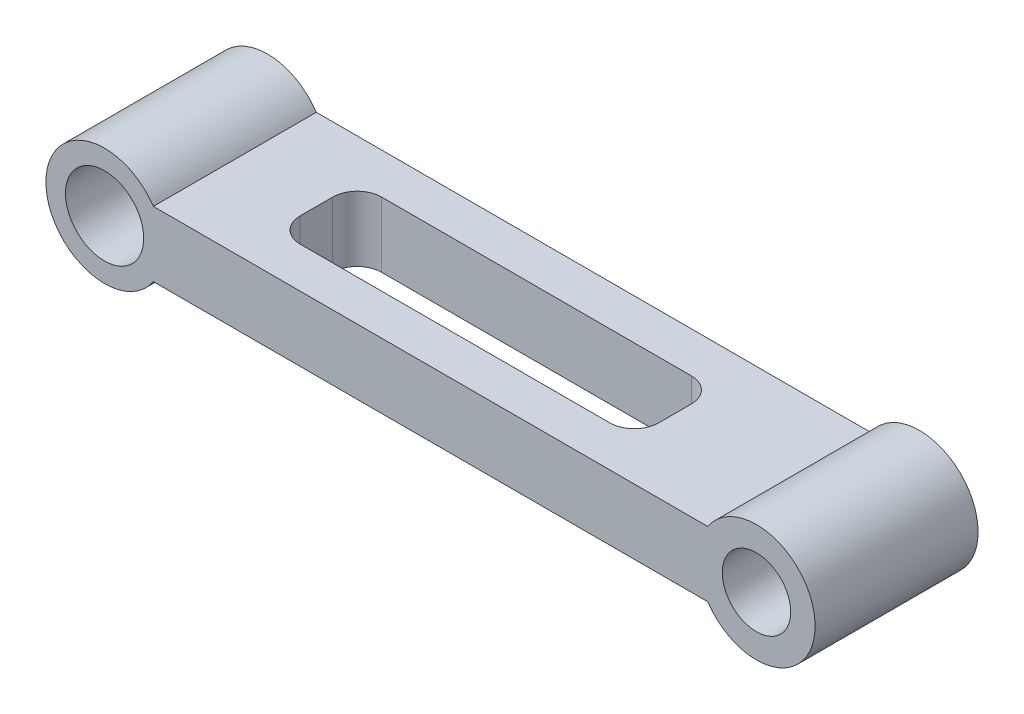
ISO-10303-21;
HEADER;
FILE_DESCRIPTION(('STEP AP214'),'2;1');
FILE_NAME('part.step','',(''),(''),'','','');
FILE_SCHEMA(('AUTOMOTIVE_DESIGN { 1 0 10303 214 1 1 1 1 }'));
ENDSEC;
DATA;
#1=APPLICATION_CONTEXT('core data for automotive mechanical design processes');
#2=APPLICATION_PROTOCOL_DEFINITION('international standard','automotive_design',2000,#1);
#3=PRODUCT_CONTEXT('',#1,'mechanical');
#4=PRODUCT('Part','Part','',(#3));
#5=PRODUCT_RELATED_PRODUCT_CATEGORY('part','',(#4));
#6=PRODUCT_DEFINITION_FORMATION('','',#4);
#7=PRODUCT_DEFINITION_CONTEXT('part definition',#1,'design');
#8=PRODUCT_DEFINITION('design','',#6,#7);
#9=PRODUCT_DEFINITION_SHAPE('','',#8);
#10=(LENGTH_UNIT() NAMED_UNIT(*) SI_UNIT(.MILLI.,.METRE.));
#11=(NAMED_UNIT(*) PLANE_ANGLE_UNIT() SI_UNIT($,.RADIAN.));
#12=(NAMED_UNIT(*) SI_UNIT($,.STERADIAN.) SOLID_ANGLE_UNIT());
#13=UNCERTAINTY_MEASURE_WITH_UNIT(LENGTH_MEASURE(1.E-05),#10,'distance_accuracy_value','');
#14=(GEOMETRIC_REPRESENTATION_CONTEXT(3) GLOBAL_UNCERTAINTY_ASSIGNED_CONTEXT((#13)) GLOBAL_UNIT_ASSIGNED_CONTEXT((#10,
#11,#12)) REPRESENTATION_CONTEXT('',''));
#15=CARTESIAN_POINT('',(0.,0.,0.));
#16=DIRECTION('',(0.,0.,1.));
#17=DIRECTION('',(1.,0.,0.));
#18=AXIS2_PLACEMENT_3D('',#15,#16,#17);
#19=CARTESIAN_POINT('',(400.,0.,50.));
#20=DIRECTION('',(0.,0.,1.));
#21=DIRECTION('',(1.,0.,0.));
#22=AXIS2_PLACEMENT_3D('',#19,#20,#21);
#23=PLANE('',#22);
#24=CARTESIAN_POINT('',(0.,0.,50.));
#25=DIRECTION('',(0.,0.,1.));
#26=DIRECTION('',(1.,0.,0.));
#27=AXIS2_PLACEMENT_3D('',#24,#25,#26);
#28=CIRCLE('',#27,24.);
#29=CARTESIAN_POINT('',(24.,0.,50.));
#30=VERTEX_POINT('',#29);
#31=EDGE_CURVE('E202',#30,#30,#28,.T.);
#32=ORIENTED_EDGE('',*,*,#31,.F.);
#33=EDGE_LOOP('',(#32));
#34=FACE_BOUND('',#33,.T.);
#35=CARTESIAN_POINT('',(400.,0.,50.));
#36=DIRECTION('',(0.,0.,1.));
#37=DIRECTION('',(1.,0.,0.));
#38=AXIS2_PLACEMENT_3D('',#35,#36,#37);
#39=CIRCLE('',#38,36.);
#40=CARTESIAN_POINT('',(370.066740905809,-20.,50.));
#41=VERTEX_POINT('',#40);
#42=CARTESIAN_POINT('',(370.066740905809,20.,50.));
#43=VERTEX_POINT('',#42);
#44=EDGE_CURVE('E210',#41,#43,#39,.T.);
#45=ORIENTED_EDGE('',*,*,#44,.T.);
#46=DIRECTION('',(-1.,0.,0.));
#47=VECTOR('',#46,1.);
#48=CARTESIAN_POINT('',(29.9332590941915,20.,50.));
#49=LINE('',#48,#47);
#50=CARTESIAN_POINT('',(29.9332590941915,20.,50.));
#51=VERTEX_POINT('',#50);
#52=EDGE_CURVE('E214',#43,#51,#49,.T.);
#53=ORIENTED_EDGE('',*,*,#52,.T.);
#54=CARTESIAN_POINT('',(0.,0.,50.));
#55=DIRECTION('',(0.,0.,1.));
#56=DIRECTION('',(1.,0.,0.));
#57=AXIS2_PLACEMENT_3D('',#54,#55,#56);
#58=CIRCLE('',#57,36.);
#59=CARTESIAN_POINT('',(29.9332590941915,-20.,50.));
#60=VERTEX_POINT('',#59);
#61=EDGE_CURVE('E218',#51,#60,#58,.T.);
#62=ORIENTED_EDGE('',*,*,#61,.T.);
#63=DIRECTION('',(1.,0.,0.));
#64=VECTOR('',#63,1.);
#65=CARTESIAN_POINT('',(29.9332590941915,-20.,50.));
#66=LINE('',#65,#64);
#67=EDGE_CURVE('E221',#60,#41,#66,.T.);
#68=ORIENTED_EDGE('',*,*,#67,.T.);
#69=EDGE_LOOP('',(#45,#53,#62,#68));
#70=FACE_BOUND('',#69,.T.);
#71=CARTESIAN_POINT('',(400.,0.,50.));
#72=DIRECTION('',(0.,0.,1.));
#73=DIRECTION('',(1.,0.,0.));
#74=AXIS2_PLACEMENT_3D('',#71,#72,#73);
#75=CIRCLE('',#74,21.);
#76=CARTESIAN_POINT('',(421.,0.,50.));
#77=VERTEX_POINT('',#76);
#78=EDGE_CURVE('E194',#77,#77,#75,.T.);
#79=ORIENTED_EDGE('',*,*,#78,.F.);
#80=EDGE_LOOP('',(#79));
#81=FACE_BOUND('',#80,.T.);
#82=ADVANCED_FACE('F39',(#34,#70,#81),#23,.T.);
#83=CARTESIAN_POINT('',(400.,0.,-50.));
#84=DIRECTION('',(0.,0.,1.));
#85=DIRECTION('',(1.,0.,0.));
#86=AXIS2_PLACEMENT_3D('',#83,#84,#85);
#87=PLANE('',#86);
#88=CARTESIAN_POINT('',(400.,0.,-50.));
#89=DIRECTION('',(0.,0.,1.));
#90=DIRECTION('',(1.,0.,0.));
#91=AXIS2_PLACEMENT_3D('',#88,#89,#90);
#92=CIRCLE('',#91,36.);
#93=CARTESIAN_POINT('',(370.066740905809,-20.,-50.));
#94=VERTEX_POINT('',#93);
#95=CARTESIAN_POINT('',(370.066740905809,20.,-50.));
#96=VERTEX_POINT('',#95);
#97=EDGE_CURVE('E206',#94,#96,#92,.T.);
#98=ORIENTED_EDGE('',*,*,#97,.F.);
#99=DIRECTION('',(1.,0.,0.));
#100=VECTOR('',#99,1.);
#101=CARTESIAN_POINT('',(29.9332590941915,-20.,-50.));
#102=LINE('',#101,#100);
#103=CARTESIAN_POINT('',(29.9332590941915,-20.,-50.));
#104=VERTEX_POINT('',#103);
#105=EDGE_CURVE('E215',#104,#94,#102,.T.);
#106=ORIENTED_EDGE('',*,*,#105,.F.);
#107=CARTESIAN_POINT('',(0.,0.,-50.));
#108=DIRECTION('',(0.,0.,1.));
#109=DIRECTION('',(1.,0.,0.));
#110=AXIS2_PLACEMENT_3D('',#107,#108,#109);
#111=CIRCLE('',#110,36.);
#112=CARTESIAN_POINT('',(29.9332590941915,20.,-50.));
#113=VERTEX_POINT('',#112);
#114=EDGE_CURVE('E231',#113,#104,#111,.T.);
#115=ORIENTED_EDGE('',*,*,#114,.F.);
#116=DIRECTION('',(-1.,0.,0.));
#117=VECTOR('',#116,1.);
#118=CARTESIAN_POINT('',(29.9332590941915,20.,-50.));
#119=LINE('',#118,#117);
#120=EDGE_CURVE('E228',#96,#113,#119,.T.);
#121=ORIENTED_EDGE('',*,*,#120,.F.);
#122=EDGE_LOOP('',(#98,#106,#115,#121));
#123=FACE_BOUND('',#122,.T.);
#124=CARTESIAN_POINT('',(0.,0.,-50.));
#125=DIRECTION('',(0.,0.,1.));
#126=DIRECTION('',(1.,0.,0.));
#127=AXIS2_PLACEMENT_3D('',#124,#125,#126);
#128=CIRCLE('',#127,24.);
#129=CARTESIAN_POINT('',(24.,0.,-50.));
#130=VERTEX_POINT('',#129);
#131=EDGE_CURVE('E198',#130,#130,#128,.T.);
#132=ORIENTED_EDGE('',*,*,#131,.T.);
#133=EDGE_LOOP('',(#132));
#134=FACE_BOUND('',#133,.T.);
#135=CARTESIAN_POINT('',(400.,0.,-50.));
#136=DIRECTION('',(0.,0.,1.));
#137=DIRECTION('',(1.,0.,0.));
#138=AXIS2_PLACEMENT_3D('',#135,#136,#137);
#139=CIRCLE('',#138,21.);
#140=CARTESIAN_POINT('',(421.,0.,-50.));
#141=VERTEX_POINT('',#140);
#142=EDGE_CURVE('E177',#141,#141,#139,.T.);
#143=ORIENTED_EDGE('',*,*,#142,.T.);
#144=EDGE_LOOP('',(#143));
#145=FACE_BOUND('',#144,.T.);
#146=ADVANCED_FACE('F309',(#123,#134,#145),#87,.F.);
#147=CARTESIAN_POINT('',(400.,0.,50.));
#148=DIRECTION('',(0.,0.,-1.));
#149=DIRECTION('',(-1.,0.,0.));
#150=AXIS2_PLACEMENT_3D('',#147,#148,#149);
#151=CYLINDRICAL_SURFACE('',#150,36.);
#152=ORIENTED_EDGE('',*,*,#97,.T.);
#153=DIRECTION('',(0.,0.,-1.));
#154=VECTOR('',#153,1.);
#155=CARTESIAN_POINT('',(370.066740905809,20.,50.));
#156=LINE('',#155,#154);
#157=EDGE_CURVE('E247',#43,#96,#156,.T.);
#158=ORIENTED_EDGE('',*,*,#157,.F.);
#159=ORIENTED_EDGE('',*,*,#44,.F.);
#160=DIRECTION('',(0.,0.,-1.));
#161=VECTOR('',#160,1.);
#162=CARTESIAN_POINT('',(370.066740905809,-20.,50.));
#163=LINE('',#162,#161);
#164=EDGE_CURVE('E224',#41,#94,#163,.T.);
#165=ORIENTED_EDGE('',*,*,#164,.T.);
#166=EDGE_LOOP('',(#152,#158,#159,#165));
#167=FACE_BOUND('',#166,.T.);
#168=ADVANCED_FACE('F41',(#167),#151,.T.);
#169=CARTESIAN_POINT('',(29.9332590941915,20.,50.));
#170=DIRECTION('',(0.,-1.,0.));
#171=DIRECTION('',(0.,0.,-1.));
#172=AXIS2_PLACEMENT_3D('',#169,#170,#171);
#173=PLANE('',#172);
#174=DIRECTION('',(-1.,0.,0.));
#175=VECTOR('',#174,1.);
#176=CARTESIAN_POINT('',(95.0000000000001,20.,-25.));
#177=LINE('',#176,#175);
#178=CARTESIAN_POINT('',(285.,20.,-25.));
#179=VERTEX_POINT('',#178);
#180=CARTESIAN_POINT('',(95.0000000000001,20.,-25.));
#181=VERTEX_POINT('',#180);
#182=EDGE_CURVE('E142',#179,#181,#177,.T.);
#183=ORIENTED_EDGE('',*,*,#182,.F.);
#184=CARTESIAN_POINT('',(285.,20.,-10.));
#185=DIRECTION('',(0.,1.,0.));
#186=DIRECTION('',(1.,0.,0.));
#187=AXIS2_PLACEMENT_3D('',#184,#185,#186);
#188=CIRCLE('',#187,15.);
#189=CARTESIAN_POINT('',(300.,20.,-9.9999999999999));
#190=VERTEX_POINT('',#189);
#191=EDGE_CURVE('E55',#190,#179,#188,.T.);
#192=ORIENTED_EDGE('',*,*,#191,.F.);
#193=DIRECTION('',(0.,0.,-1.));
#194=VECTOR('',#193,1.);
#195=CARTESIAN_POINT('',(300.,20.,-9.9999999999999));
#196=LINE('',#195,#194);
#197=CARTESIAN_POINT('',(300.,20.,9.9999999999999));
#198=VERTEX_POINT('',#197);
#199=EDGE_CURVE('E170',#198,#190,#196,.T.);
#200=ORIENTED_EDGE('',*,*,#199,.F.);
#201=CARTESIAN_POINT('',(285.,20.,10.));
#202=DIRECTION('',(0.,1.,0.));
#203=DIRECTION('',(-1.,0.,0.));
#204=AXIS2_PLACEMENT_3D('',#201,#202,#203);
#205=CIRCLE('',#204,15.);
#206=CARTESIAN_POINT('',(285.,20.,25.));
#207=VERTEX_POINT('',#206);
#208=EDGE_CURVE('E166',#207,#198,#205,.T.);
#209=ORIENTED_EDGE('',*,*,#208,.F.);
#210=DIRECTION('',(1.,0.,0.));
#211=VECTOR('',#210,1.);
#212=CARTESIAN_POINT('',(95.0000000000001,20.,25.));
#213=LINE('',#212,#211);
#214=CARTESIAN_POINT('',(95.0000000000001,20.,25.));
#215=VERTEX_POINT('',#214);
#216=EDGE_CURVE('E162',#215,#207,#213,.T.);
#217=ORIENTED_EDGE('',*,*,#216,.F.);
#218=CARTESIAN_POINT('',(95.,20.,10.));
#219=DIRECTION('',(0.,1.,0.));
#220=DIRECTION('',(-1.,0.,0.));
#221=AXIS2_PLACEMENT_3D('',#218,#219,#220);
#222=CIRCLE('',#221,15.);
#223=CARTESIAN_POINT('',(80.,20.,9.9999999999999));
#224=VERTEX_POINT('',#223);
#225=EDGE_CURVE('E155',#224,#215,#222,.T.);
#226=ORIENTED_EDGE('',*,*,#225,.F.);
#227=DIRECTION('',(0.,0.,1.));
#228=VECTOR('',#227,1.);
#229=CARTESIAN_POINT('',(80.,20.,-9.9999999999999));
#230=LINE('',#229,#228);
#231=CARTESIAN_POINT('',(80.,20.,-10.));
#232=VERTEX_POINT('',#231);
#233=EDGE_CURVE('E151',#232,#224,#230,.T.);
#234=ORIENTED_EDGE('',*,*,#233,.F.);
#235=CARTESIAN_POINT('',(95.,20.,-10.));
#236=DIRECTION('',(0.,1.,0.));
#237=DIRECTION('',(-1.,0.,0.));
#238=AXIS2_PLACEMENT_3D('',#235,#236,#237);
#239=CIRCLE('',#238,15.);
#240=EDGE_CURVE('E132',#181,#232,#239,.T.);
#241=ORIENTED_EDGE('',*,*,#240,.F.);
#242=EDGE_LOOP('',(#183,#192,#200,#209,#217,#226,#234,#241));
#243=FACE_BOUND('',#242,.T.);
#244=ORIENTED_EDGE('',*,*,#120,.T.);
#245=DIRECTION('',(0.,0.,-1.));
#246=VECTOR('',#245,1.);
#247=CARTESIAN_POINT('',(29.9332590941915,20.,50.));
#248=LINE('',#247,#246);
#249=EDGE_CURVE('E243',#51,#113,#248,.T.);
#250=ORIENTED_EDGE('',*,*,#249,.F.);
#251=ORIENTED_EDGE('',*,*,#52,.F.);
#252=ORIENTED_EDGE('',*,*,#157,.T.);
#253=EDGE_LOOP('',(#244,#250,#251,#252));
#254=FACE_BOUND('',#253,.T.);
#255=ADVANCED_FACE('F147',(#243,#254),#173,.F.);
#256=CARTESIAN_POINT('',(0.,0.,50.));
#257=DIRECTION('',(0.,0.,-1.));
#258=DIRECTION('',(-1.,0.,0.));
#259=AXIS2_PLACEMENT_3D('',#256,#257,#258);
#260=CYLINDRICAL_SURFACE('',#259,36.);
#261=ORIENTED_EDGE('',*,*,#114,.T.);
#262=DIRECTION('',(0.,0.,-1.));
#263=VECTOR('',#262,1.);
#264=CARTESIAN_POINT('',(29.9332590941915,-20.,50.));
#265=LINE('',#264,#263);
#266=EDGE_CURVE('E239',#60,#104,#265,.T.);
#267=ORIENTED_EDGE('',*,*,#266,.F.);
#268=ORIENTED_EDGE('',*,*,#61,.F.);
#269=ORIENTED_EDGE('',*,*,#249,.T.);
#270=EDGE_LOOP('',(#261,#267,#268,#269));
#271=FACE_BOUND('',#270,.T.);
#272=ADVANCED_FACE('F323',(#271),#260,.T.);
#273=CARTESIAN_POINT('',(29.9332590941915,-20.,50.));
#274=DIRECTION('',(0.,1.,0.));
#275=DIRECTION('',(0.,0.,1.));
#276=AXIS2_PLACEMENT_3D('',#273,#274,#275);
#277=PLANE('',#276);
#278=DIRECTION('',(0.,0.,-1.));
#279=VECTOR('',#278,1.);
#280=CARTESIAN_POINT('',(300.,-20.,50.));
#281=LINE('',#280,#279);
#282=CARTESIAN_POINT('',(300.,-20.,9.9999999999999));
#283=VERTEX_POINT('',#282);
#284=CARTESIAN_POINT('',(300.,-20.,-9.9999999999999));
#285=VERTEX_POINT('',#284);
#286=EDGE_CURVE('E48',#283,#285,#281,.T.);
#287=ORIENTED_EDGE('',*,*,#286,.T.);
#288=CARTESIAN_POINT('',(285.,-20.,-10.));
#289=DIRECTION('',(0.,1.,0.));
#290=DIRECTION('',(0.,0.,1.));
#291=AXIS2_PLACEMENT_3D('',#288,#289,#290);
#292=CIRCLE('',#291,15.);
#293=CARTESIAN_POINT('',(285.,-20.,-25.));
#294=VERTEX_POINT('',#293);
#295=EDGE_CURVE('E11',#285,#294,#292,.T.);
#296=ORIENTED_EDGE('',*,*,#295,.T.);
#297=DIRECTION('',(-1.,0.,0.));
#298=VECTOR('',#297,1.);
#299=CARTESIAN_POINT('',(29.9332590941915,-20.,-25.));
#300=LINE('',#299,#298);
#301=CARTESIAN_POINT('',(95.0000000000001,-20.,-25.));
#302=VERTEX_POINT('',#301);
#303=EDGE_CURVE('E251',#294,#302,#300,.T.);
#304=ORIENTED_EDGE('',*,*,#303,.T.);
#305=CARTESIAN_POINT('',(95.,-20.,-10.));
#306=DIRECTION('',(0.,1.,0.));
#307=DIRECTION('',(0.,0.,1.));
#308=AXIS2_PLACEMENT_3D('',#305,#306,#307);
#309=CIRCLE('',#308,15.);
#310=CARTESIAN_POINT('',(80.,-20.,-10.));
#311=VERTEX_POINT('',#310);
#312=EDGE_CURVE('E135',#302,#311,#309,.T.);
#313=ORIENTED_EDGE('',*,*,#312,.T.);
#314=DIRECTION('',(0.,0.,1.));
#315=VECTOR('',#314,1.);
#316=CARTESIAN_POINT('',(80.,-20.,50.));
#317=LINE('',#316,#315);
#318=CARTESIAN_POINT('',(80.,-20.,9.9999999999999));
#319=VERTEX_POINT('',#318);
#320=EDGE_CURVE('E256',#311,#319,#317,.T.);
#321=ORIENTED_EDGE('',*,*,#320,.T.);
#322=CARTESIAN_POINT('',(95.,-20.,10.));
#323=DIRECTION('',(0.,1.,0.));
#324=DIRECTION('',(0.,0.,1.));
#325=AXIS2_PLACEMENT_3D('',#322,#323,#324);
#326=CIRCLE('',#325,15.);
#327=CARTESIAN_POINT('',(95.0000000000001,-20.,25.));
#328=VERTEX_POINT('',#327);
#329=EDGE_CURVE('E260',#319,#328,#326,.T.);
#330=ORIENTED_EDGE('',*,*,#329,.T.);
#331=DIRECTION('',(1.,0.,0.));
#332=VECTOR('',#331,1.);
#333=CARTESIAN_POINT('',(29.9332590941915,-20.,25.));
#334=LINE('',#333,#332);
#335=CARTESIAN_POINT('',(285.,-20.,25.));
#336=VERTEX_POINT('',#335);
#337=EDGE_CURVE('E264',#328,#336,#334,.T.);
#338=ORIENTED_EDGE('',*,*,#337,.T.);
#339=CARTESIAN_POINT('',(285.,-20.,10.));
#340=DIRECTION('',(0.,1.,0.));
#341=DIRECTION('',(0.,0.,1.));
#342=AXIS2_PLACEMENT_3D('',#339,#340,#341);
#343=CIRCLE('',#342,15.);
#344=EDGE_CURVE('E268',#336,#283,#343,.T.);
#345=ORIENTED_EDGE('',*,*,#344,.T.);
#346=EDGE_LOOP('',(#287,#296,#304,#313,#321,#330,#338,#345));
#347=FACE_BOUND('',#346,.T.);
#348=ORIENTED_EDGE('',*,*,#105,.T.);
#349=ORIENTED_EDGE('',*,*,#164,.F.);
#350=ORIENTED_EDGE('',*,*,#67,.F.);
#351=ORIENTED_EDGE('',*,*,#266,.T.);
#352=EDGE_LOOP('',(#348,#349,#350,#351));
#353=FACE_BOUND('',#352,.T.);
#354=ADVANCED_FACE('F274',(#347,#353),#277,.F.);
#355=CARTESIAN_POINT('',(0.,0.,50.));
#356=DIRECTION('',(0.,0.,-1.));
#357=DIRECTION('',(-1.,0.,0.));
#358=AXIS2_PLACEMENT_3D('',#355,#356,#357);
#359=CYLINDRICAL_SURFACE('',#358,24.);
#360=ORIENTED_EDGE('',*,*,#31,.T.);
#361=EDGE_LOOP('',(#360));
#362=FACE_BOUND('',#361,.T.);
#363=ORIENTED_EDGE('',*,*,#131,.F.);
#364=EDGE_LOOP('',(#363));
#365=FACE_BOUND('',#364,.T.);
#366=ADVANCED_FACE('F304',(#362,#365),#359,.F.);
#367=CARTESIAN_POINT('',(400.,0.,50.));
#368=DIRECTION('',(0.,0.,-1.));
#369=DIRECTION('',(-1.,0.,0.));
#370=AXIS2_PLACEMENT_3D('',#367,#368,#369);
#371=CYLINDRICAL_SURFACE('',#370,21.);
#372=ORIENTED_EDGE('',*,*,#78,.T.);
#373=EDGE_LOOP('',(#372));
#374=FACE_BOUND('',#373,.T.);
#375=ORIENTED_EDGE('',*,*,#142,.F.);
#376=EDGE_LOOP('',(#375));
#377=FACE_BOUND('',#376,.T.);
#378=ADVANCED_FACE('F297',(#374,#377),#371,.F.);
#379=CARTESIAN_POINT('',(285.,-36.,-10.));
#380=DIRECTION('',(0.,1.,0.));
#381=DIRECTION('',(-1.,0.,0.));
#382=AXIS2_PLACEMENT_3D('',#379,#380,#381);
#383=CYLINDRICAL_SURFACE('',#382,15.);
#384=DIRECTION('',(0.,1.,0.));
#385=VECTOR('',#384,1.);
#386=CARTESIAN_POINT('',(300.,-36.,-9.9999999999999));
#387=LINE('',#386,#385);
#388=EDGE_CURVE('E174',#285,#190,#387,.T.);
#389=ORIENTED_EDGE('',*,*,#388,.T.);
#390=ORIENTED_EDGE('',*,*,#191,.T.);
#391=DIRECTION('',(0.,1.,0.));
#392=VECTOR('',#391,1.);
#393=CARTESIAN_POINT('',(285.,-36.,-25.));
#394=LINE('',#393,#392);
#395=EDGE_CURVE('E139',#294,#179,#394,.T.);
#396=ORIENTED_EDGE('',*,*,#395,.F.);
#397=ORIENTED_EDGE('',*,*,#295,.F.);
#398=EDGE_LOOP('',(#389,#390,#396,#397));
#399=FACE_BOUND('',#398,.T.);
#400=ADVANCED_FACE('F295',(#399),#383,.F.);
#401=CARTESIAN_POINT('',(300.,-36.,-9.9999999999999));
#402=DIRECTION('',(1.,0.,0.));
#403=DIRECTION('',(0.,1.,0.));
#404=AXIS2_PLACEMENT_3D('',#401,#402,#403);
#405=PLANE('',#404);
#406=DIRECTION('',(0.,1.,0.));
#407=VECTOR('',#406,1.);
#408=CARTESIAN_POINT('',(300.,-36.,9.9999999999999));
#409=LINE('',#408,#407);
#410=EDGE_CURVE('E178',#283,#198,#409,.T.);
#411=ORIENTED_EDGE('',*,*,#410,.T.);
#412=ORIENTED_EDGE('',*,*,#199,.T.);
#413=ORIENTED_EDGE('',*,*,#388,.F.);
#414=ORIENTED_EDGE('',*,*,#286,.F.);
#415=EDGE_LOOP('',(#411,#412,#413,#414));
#416=FACE_BOUND('',#415,.T.);
#417=ADVANCED_FACE('F279',(#416),#405,.F.);
#418=CARTESIAN_POINT('',(285.,-36.,10.));
#419=DIRECTION('',(0.,1.,0.));
#420=DIRECTION('',(-1.,0.,0.));
#421=AXIS2_PLACEMENT_3D('',#418,#419,#420);
#422=CYLINDRICAL_SURFACE('',#421,15.);
#423=DIRECTION('',(0.,1.,0.));
#424=VECTOR('',#423,1.);
#425=CARTESIAN_POINT('',(285.,-36.,25.));
#426=LINE('',#425,#424);
#427=EDGE_CURVE('E181',#336,#207,#426,.T.);
#428=ORIENTED_EDGE('',*,*,#427,.T.);
#429=ORIENTED_EDGE('',*,*,#208,.T.);
#430=ORIENTED_EDGE('',*,*,#410,.F.);
#431=ORIENTED_EDGE('',*,*,#344,.F.);
#432=EDGE_LOOP('',(#428,#429,#430,#431));
#433=FACE_BOUND('',#432,.T.);
#434=ADVANCED_FACE('F281',(#433),#422,.F.);
#435=CARTESIAN_POINT('',(95.0000000000001,-36.,25.));
#436=DIRECTION('',(0.,0.,1.));
#437=DIRECTION('',(1.,0.,0.));
#438=AXIS2_PLACEMENT_3D('',#435,#436,#437);
#439=PLANE('',#438);
#440=DIRECTION('',(0.,1.,0.));
#441=VECTOR('',#440,1.);
#442=CARTESIAN_POINT('',(95.0000000000001,-36.,25.));
#443=LINE('',#442,#441);
#444=EDGE_CURVE('E184',#328,#215,#443,.T.);
#445=ORIENTED_EDGE('',*,*,#444,.T.);
#446=ORIENTED_EDGE('',*,*,#216,.T.);
#447=ORIENTED_EDGE('',*,*,#427,.F.);
#448=ORIENTED_EDGE('',*,*,#337,.F.);
#449=EDGE_LOOP('',(#445,#446,#447,#448));
#450=FACE_BOUND('',#449,.T.);
#451=ADVANCED_FACE('F288',(#450),#439,.F.);
#452=CARTESIAN_POINT('',(95.,-36.,10.));
#453=DIRECTION('',(0.,1.,0.));
#454=DIRECTION('',(-1.,0.,0.));
#455=AXIS2_PLACEMENT_3D('',#452,#453,#454);
#456=CYLINDRICAL_SURFACE('',#455,15.);
#457=DIRECTION('',(0.,1.,0.));
#458=VECTOR('',#457,1.);
#459=CARTESIAN_POINT('',(80.,-36.,9.9999999999999));
#460=LINE('',#459,#458);
#461=EDGE_CURVE('E187',#319,#224,#460,.T.);
#462=ORIENTED_EDGE('',*,*,#461,.T.);
#463=ORIENTED_EDGE('',*,*,#225,.T.);
#464=ORIENTED_EDGE('',*,*,#444,.F.);
#465=ORIENTED_EDGE('',*,*,#329,.F.);
#466=EDGE_LOOP('',(#462,#463,#464,#465));
#467=FACE_BOUND('',#466,.T.);
#468=ADVANCED_FACE('F291',(#467),#456,.F.);
#469=CARTESIAN_POINT('',(80.,-36.,-9.9999999999999));
#470=DIRECTION('',(-1.,0.,0.));
#471=DIRECTION('',(0.,-1.,0.));
#472=AXIS2_PLACEMENT_3D('',#469,#470,#471);
#473=PLANE('',#472);
#474=DIRECTION('',(0.,1.,0.));
#475=VECTOR('',#474,1.);
#476=CARTESIAN_POINT('',(80.,-36.,-10.));
#477=LINE('',#476,#475);
#478=EDGE_CURVE('E138',#311,#232,#477,.T.);
#479=ORIENTED_EDGE('',*,*,#478,.T.);
#480=ORIENTED_EDGE('',*,*,#233,.T.);
#481=ORIENTED_EDGE('',*,*,#461,.F.);
#482=ORIENTED_EDGE('',*,*,#320,.F.);
#483=EDGE_LOOP('',(#479,#480,#481,#482));
#484=FACE_BOUND('',#483,.T.);
#485=ADVANCED_FACE('F294',(#484),#473,.F.);
#486=CARTESIAN_POINT('',(95.,-36.,-10.));
#487=DIRECTION('',(0.,1.,0.));
#488=DIRECTION('',(-1.,0.,0.));
#489=AXIS2_PLACEMENT_3D('',#486,#487,#488);
#490=CYLINDRICAL_SURFACE('',#489,15.);
#491=DIRECTION('',(0.,1.,0.));
#492=VECTOR('',#491,1.);
#493=CARTESIAN_POINT('',(95.0000000000001,-36.,-25.));
#494=LINE('',#493,#492);
#495=EDGE_CURVE('E63',#302,#181,#494,.T.);
#496=ORIENTED_EDGE('',*,*,#495,.T.);
#497=ORIENTED_EDGE('',*,*,#240,.T.);
#498=ORIENTED_EDGE('',*,*,#478,.F.);
#499=ORIENTED_EDGE('',*,*,#312,.F.);
#500=EDGE_LOOP('',(#496,#497,#498,#499));
#501=FACE_BOUND('',#500,.T.);
#502=ADVANCED_FACE('F129',(#501),#490,.F.);
#503=CARTESIAN_POINT('',(95.0000000000001,-36.,-25.));
#504=DIRECTION('',(0.,0.,-1.));
#505=DIRECTION('',(-1.,0.,0.));
#506=AXIS2_PLACEMENT_3D('',#503,#504,#505);
#507=PLANE('',#506);
#508=ORIENTED_EDGE('',*,*,#395,.T.);
#509=ORIENTED_EDGE('',*,*,#182,.T.);
#510=ORIENTED_EDGE('',*,*,#495,.F.);
#511=ORIENTED_EDGE('',*,*,#303,.F.);
#512=EDGE_LOOP('',(#508,#509,#510,#511));
#513=FACE_BOUND('',#512,.T.);
#514=ADVANCED_FACE('F143',(#513),#507,.F.);
#515=CLOSED_SHELL('',(#82,#146,#168,#255,#272,#354,#366,#378,#400,#417,#434,#451,#468,#485,#502,#514));
#516=MANIFOLD_SOLID_BREP('B2',#515);
#517=ADVANCED_BREP_SHAPE_REPRESENTATION('',(#18,#516),#14);
#518=SHAPE_DEFINITION_REPRESENTATION(#9,#517);
ENDSEC;
END-ISO-10303-21;
